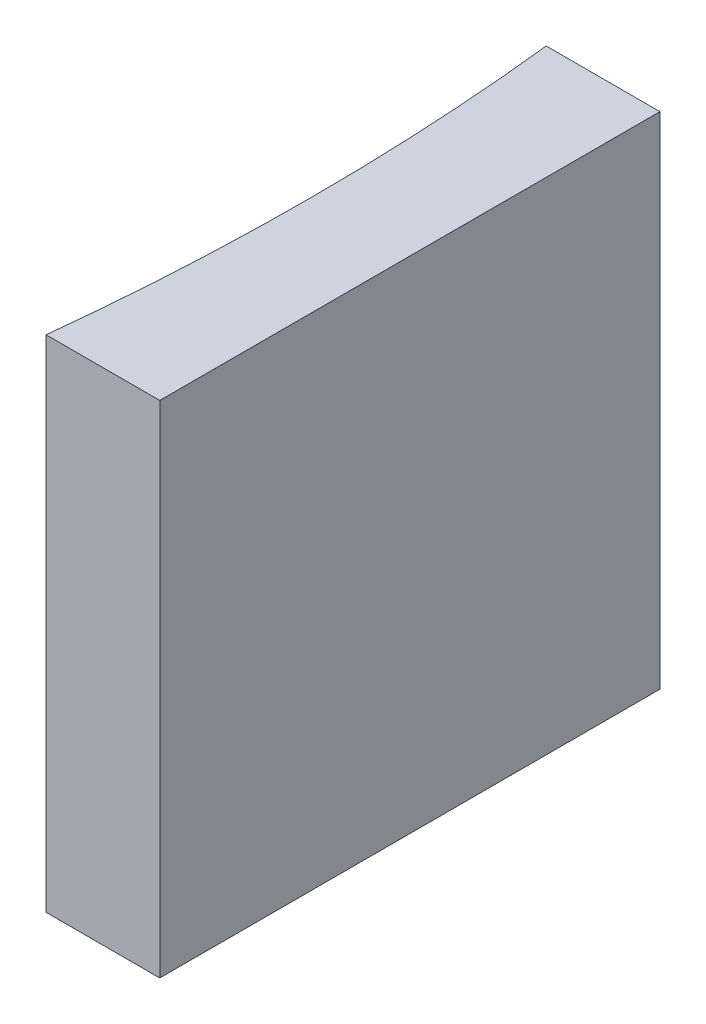
ISO-10303-21;
HEADER;
FILE_DESCRIPTION(('STEP AP214'),'2;1');
FILE_NAME('part.step','',(''),(''),'','','');
FILE_SCHEMA(('AUTOMOTIVE_DESIGN { 1 0 10303 214 1 1 1 1 }'));
ENDSEC;
DATA;
#1=APPLICATION_CONTEXT('core data for automotive mechanical design processes');
#2=APPLICATION_PROTOCOL_DEFINITION('international standard','automotive_design',2000,#1);
#3=PRODUCT_CONTEXT('',#1,'mechanical');
#4=PRODUCT('Part','Part','',(#3));
#5=PRODUCT_RELATED_PRODUCT_CATEGORY('part','',(#4));
#6=PRODUCT_DEFINITION_FORMATION('','',#4);
#7=PRODUCT_DEFINITION_CONTEXT('part definition',#1,'design');
#8=PRODUCT_DEFINITION('design','',#6,#7);
#9=PRODUCT_DEFINITION_SHAPE('','',#8);
#10=(LENGTH_UNIT() NAMED_UNIT(*) SI_UNIT(.MILLI.,.METRE.));
#11=(NAMED_UNIT(*) PLANE_ANGLE_UNIT() SI_UNIT($,.RADIAN.));
#12=(NAMED_UNIT(*) SI_UNIT($,.STERADIAN.) SOLID_ANGLE_UNIT());
#13=UNCERTAINTY_MEASURE_WITH_UNIT(LENGTH_MEASURE(1.E-05),#10,'distance_accuracy_value','');
#14=(GEOMETRIC_REPRESENTATION_CONTEXT(3) GLOBAL_UNCERTAINTY_ASSIGNED_CONTEXT((#13)) GLOBAL_UNIT_ASSIGNED_CONTEXT((#10,
#11,#12)) REPRESENTATION_CONTEXT('',''));
#15=CARTESIAN_POINT('',(0.,0.,0.));
#16=DIRECTION('',(0.,0.,1.));
#17=DIRECTION('',(1.,0.,0.));
#18=AXIS2_PLACEMENT_3D('',#15,#16,#17);
#19=CARTESIAN_POINT('',(0.,10.,0.));
#20=DIRECTION('',(0.,0.,1.));
#21=DIRECTION('',(1.,0.,0.));
#22=AXIS2_PLACEMENT_3D('',#19,#20,#21);
#23=PLANE('',#22);
#24=DIRECTION('',(-1.,0.,0.));
#25=VECTOR('',#24,1.);
#26=CARTESIAN_POINT('',(0.,0.,0.));
#27=LINE('',#26,#25);
#28=CARTESIAN_POINT('',(0.,0.,0.));
#29=VERTEX_POINT('',#28);
#30=CARTESIAN_POINT('',(-2.27344352630401,0.,0.));
#31=VERTEX_POINT('',#30);
#32=EDGE_CURVE('E100',#29,#31,#27,.T.);
#33=ORIENTED_EDGE('',*,*,#32,.T.);
#34=DIRECTION('',(0.,-1.,0.));
#35=VECTOR('',#34,1.);
#36=CARTESIAN_POINT('',(-2.27344352630401,10.,0.));
#37=LINE('',#36,#35);
#38=CARTESIAN_POINT('',(-2.27344352630401,10.,0.));
#39=VERTEX_POINT('',#38);
#40=EDGE_CURVE('E11',#39,#31,#37,.T.);
#41=ORIENTED_EDGE('',*,*,#40,.F.);
#42=DIRECTION('',(-1.,0.,0.));
#43=VECTOR('',#42,1.);
#44=CARTESIAN_POINT('',(0.,10.,0.));
#45=LINE('',#44,#43);
#46=CARTESIAN_POINT('',(0.,10.,0.));
#47=VERTEX_POINT('',#46);
#48=EDGE_CURVE('E88',#47,#39,#45,.T.);
#49=ORIENTED_EDGE('',*,*,#48,.F.);
#50=DIRECTION('',(0.,-1.,0.));
#51=VECTOR('',#50,1.);
#52=CARTESIAN_POINT('',(0.,10.,0.));
#53=LINE('',#52,#51);
#54=EDGE_CURVE('E96',#47,#29,#53,.T.);
#55=ORIENTED_EDGE('',*,*,#54,.T.);
#56=EDGE_LOOP('',(#33,#41,#49,#55));
#57=FACE_BOUND('',#56,.T.);
#58=ADVANCED_FACE('F37',(#57),#23,.F.);
#59=CARTESIAN_POINT('',(-47.85,10.,5.));
#60=DIRECTION('',(0.,-1.,0.));
#61=DIRECTION('',(0.,0.,-1.));
#62=AXIS2_PLACEMENT_3D('',#59,#60,#61);
#63=CYLINDRICAL_SURFACE('',#62,45.85);
#64=CARTESIAN_POINT('',(-47.85,0.,5.));
#65=DIRECTION('',(0.,-1.,0.));
#66=DIRECTION('',(0.,0.,1.));
#67=AXIS2_PLACEMENT_3D('',#64,#65,#66);
#68=CIRCLE('',#67,45.85);
#69=CARTESIAN_POINT('',(-2.27344352630401,0.,10.));
#70=VERTEX_POINT('',#69);
#71=EDGE_CURVE('E92',#31,#70,#68,.T.);
#72=ORIENTED_EDGE('',*,*,#71,.T.);
#73=DIRECTION('',(0.,-1.,0.));
#74=VECTOR('',#73,1.);
#75=CARTESIAN_POINT('',(-2.27344352630401,10.,10.));
#76=LINE('',#75,#74);
#77=CARTESIAN_POINT('',(-2.27344352630401,10.,10.));
#78=VERTEX_POINT('',#77);
#79=EDGE_CURVE('E45',#78,#70,#76,.T.);
#80=ORIENTED_EDGE('',*,*,#79,.F.);
#81=CARTESIAN_POINT('',(-47.85,10.,5.));
#82=DIRECTION('',(0.,-1.,0.));
#83=DIRECTION('',(0.,0.,1.));
#84=AXIS2_PLACEMENT_3D('',#81,#82,#83);
#85=CIRCLE('',#84,45.85);
#86=EDGE_CURVE('E83',#39,#78,#85,.T.);
#87=ORIENTED_EDGE('',*,*,#86,.F.);
#88=ORIENTED_EDGE('',*,*,#40,.T.);
#89=EDGE_LOOP('',(#72,#80,#87,#88));
#90=FACE_BOUND('',#89,.T.);
#91=ADVANCED_FACE('F91',(#90),#63,.F.);
#92=CARTESIAN_POINT('',(0.,10.,10.));
#93=DIRECTION('',(0.,0.,-1.));
#94=DIRECTION('',(-1.,0.,0.));
#95=AXIS2_PLACEMENT_3D('',#92,#93,#94);
#96=PLANE('',#95);
#97=DIRECTION('',(1.,0.,0.));
#98=VECTOR('',#97,1.);
#99=CARTESIAN_POINT('',(0.,0.,10.));
#100=LINE('',#99,#98);
#101=CARTESIAN_POINT('',(0.,0.,10.));
#102=VERTEX_POINT('',#101);
#103=EDGE_CURVE('E70',#70,#102,#100,.T.);
#104=ORIENTED_EDGE('',*,*,#103,.T.);
#105=DIRECTION('',(0.,-1.,0.));
#106=VECTOR('',#105,1.);
#107=CARTESIAN_POINT('',(0.,10.,10.));
#108=LINE('',#107,#106);
#109=CARTESIAN_POINT('',(0.,10.,10.));
#110=VERTEX_POINT('',#109);
#111=EDGE_CURVE('E93',#110,#102,#108,.T.);
#112=ORIENTED_EDGE('',*,*,#111,.F.);
#113=DIRECTION('',(1.,0.,0.));
#114=VECTOR('',#113,1.);
#115=CARTESIAN_POINT('',(0.,10.,10.));
#116=LINE('',#115,#114);
#117=EDGE_CURVE('E86',#78,#110,#116,.T.);
#118=ORIENTED_EDGE('',*,*,#117,.F.);
#119=ORIENTED_EDGE('',*,*,#79,.T.);
#120=EDGE_LOOP('',(#104,#112,#118,#119));
#121=FACE_BOUND('',#120,.T.);
#122=ADVANCED_FACE('F94',(#121),#96,.F.);
#123=CARTESIAN_POINT('',(0.,10.,0.));
#124=DIRECTION('',(-1.,0.,0.));
#125=DIRECTION('',(0.,0.,1.));
#126=AXIS2_PLACEMENT_3D('',#123,#124,#125);
#127=PLANE('',#126);
#128=DIRECTION('',(0.,0.,-1.));
#129=VECTOR('',#128,1.);
#130=CARTESIAN_POINT('',(0.,0.,0.));
#131=LINE('',#130,#129);
#132=EDGE_CURVE('E76',#102,#29,#131,.T.);
#133=ORIENTED_EDGE('',*,*,#132,.T.);
#134=ORIENTED_EDGE('',*,*,#54,.F.);
#135=DIRECTION('',(0.,0.,-1.));
#136=VECTOR('',#135,1.);
#137=CARTESIAN_POINT('',(0.,10.,0.));
#138=LINE('',#137,#136);
#139=EDGE_CURVE('E53',#110,#47,#138,.T.);
#140=ORIENTED_EDGE('',*,*,#139,.F.);
#141=ORIENTED_EDGE('',*,*,#111,.T.);
#142=EDGE_LOOP('',(#133,#134,#140,#141));
#143=FACE_BOUND('',#142,.T.);
#144=ADVANCED_FACE('F107',(#143),#127,.F.);
#145=CARTESIAN_POINT('',(-47.85,10.,5.));
#146=DIRECTION('',(0.,1.,0.));
#147=DIRECTION('',(0.,0.,1.));
#148=AXIS2_PLACEMENT_3D('',#145,#146,#147);
#149=PLANE('',#148);
#150=ORIENTED_EDGE('',*,*,#48,.T.);
#151=ORIENTED_EDGE('',*,*,#86,.T.);
#152=ORIENTED_EDGE('',*,*,#117,.T.);
#153=ORIENTED_EDGE('',*,*,#139,.T.);
#154=EDGE_LOOP('',(#150,#151,#152,#153));
#155=FACE_BOUND('',#154,.T.);
#156=ADVANCED_FACE('F84',(#155),#149,.T.);
#157=CARTESIAN_POINT('',(-47.85,0.,5.));
#158=DIRECTION('',(0.,1.,0.));
#159=DIRECTION('',(0.,0.,1.));
#160=AXIS2_PLACEMENT_3D('',#157,#158,#159);
#161=PLANE('',#160);
#162=ORIENTED_EDGE('',*,*,#32,.F.);
#163=ORIENTED_EDGE('',*,*,#132,.F.);
#164=ORIENTED_EDGE('',*,*,#103,.F.);
#165=ORIENTED_EDGE('',*,*,#71,.F.);
#166=EDGE_LOOP('',(#162,#163,#164,#165));
#167=FACE_BOUND('',#166,.T.);
#168=ADVANCED_FACE('F110',(#167),#161,.F.);
#169=CLOSED_SHELL('',(#58,#91,#122,#144,#156,#168));
#170=MANIFOLD_SOLID_BREP('B2',#169);
#171=ADVANCED_BREP_SHAPE_REPRESENTATION('',(#18,#170),#14);
#172=SHAPE_DEFINITION_REPRESENTATION(#9,#171);
ENDSEC;
END-ISO-10303-21;
